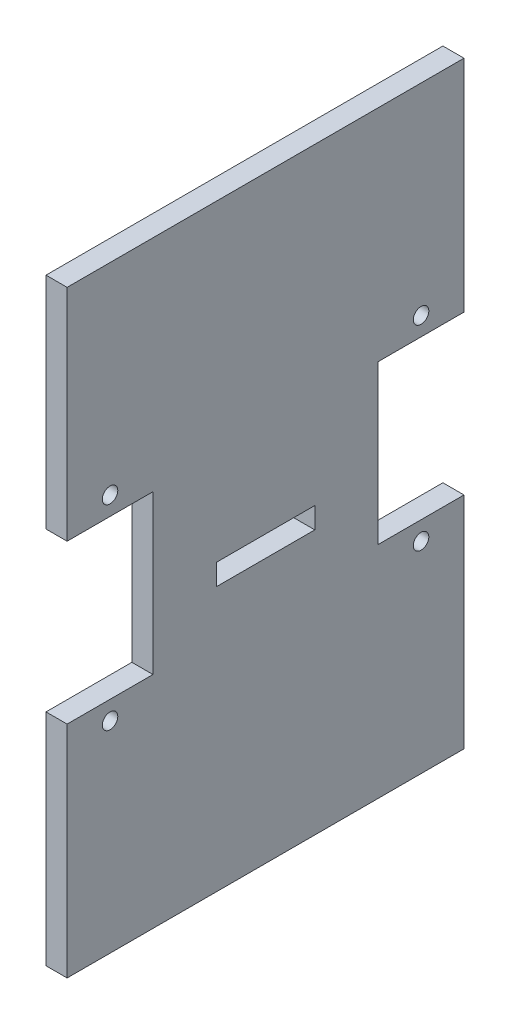
ISO-10303-21;
HEADER;
FILE_DESCRIPTION(('STEP AP214'),'2;1');
FILE_NAME('part.step','',(''),(''),'','','');
FILE_SCHEMA(('AUTOMOTIVE_DESIGN { 1 0 10303 214 1 1 1 1 }'));
ENDSEC;
DATA;
#1=APPLICATION_CONTEXT('core data for automotive mechanical design processes');
#2=APPLICATION_PROTOCOL_DEFINITION('international standard','automotive_design',2000,#1);
#3=PRODUCT_CONTEXT('',#1,'mechanical');
#4=PRODUCT('Part','Part','',(#3));
#5=PRODUCT_RELATED_PRODUCT_CATEGORY('part','',(#4));
#6=PRODUCT_DEFINITION_FORMATION('','',#4);
#7=PRODUCT_DEFINITION_CONTEXT('part definition',#1,'design');
#8=PRODUCT_DEFINITION('design','',#6,#7);
#9=PRODUCT_DEFINITION_SHAPE('','',#8);
#10=(LENGTH_UNIT() NAMED_UNIT(*) SI_UNIT(.MILLI.,.METRE.));
#11=(NAMED_UNIT(*) PLANE_ANGLE_UNIT() SI_UNIT($,.RADIAN.));
#12=(NAMED_UNIT(*) SI_UNIT($,.STERADIAN.) SOLID_ANGLE_UNIT());
#13=UNCERTAINTY_MEASURE_WITH_UNIT(LENGTH_MEASURE(1.E-05),#10,'distance_accuracy_value','');
#14=(GEOMETRIC_REPRESENTATION_CONTEXT(3) GLOBAL_UNCERTAINTY_ASSIGNED_CONTEXT((#13)) GLOBAL_UNIT_ASSIGNED_CONTEXT((#10,
#11,#12)) REPRESENTATION_CONTEXT('',''));
#15=CARTESIAN_POINT('',(0.,0.,0.));
#16=DIRECTION('',(0.,0.,1.));
#17=DIRECTION('',(1.,0.,0.));
#18=AXIS2_PLACEMENT_3D('',#15,#16,#17);
#19=CARTESIAN_POINT('',(3.,0.,0.));
#20=DIRECTION('',(-1.,0.,0.));
#21=DIRECTION('',(0.,0.,1.));
#22=AXIS2_PLACEMENT_3D('',#19,#20,#21);
#23=PLANE('',#22);
#24=DIRECTION('',(0.,0.,-1.));
#25=VECTOR('',#24,1.);
#26=CARTESIAN_POINT('',(3.,-4.95000000000001,7.));
#27=LINE('',#26,#25);
#28=CARTESIAN_POINT('',(3.,-4.95000000000001,7.));
#29=VERTEX_POINT('',#28);
#30=CARTESIAN_POINT('',(3.,-4.95,-7.));
#31=VERTEX_POINT('',#30);
#32=EDGE_CURVE('E172',#29,#31,#27,.T.);
#33=ORIENTED_EDGE('',*,*,#32,.F.);
#34=DIRECTION('',(0.,-1.,0.));
#35=VECTOR('',#34,1.);
#36=CARTESIAN_POINT('',(3.,-1.95000000000001,7.));
#37=LINE('',#36,#35);
#38=CARTESIAN_POINT('',(3.,-1.95000000000001,7.));
#39=VERTEX_POINT('',#38);
#40=EDGE_CURVE('E47',#39,#29,#37,.T.);
#41=ORIENTED_EDGE('',*,*,#40,.F.);
#42=DIRECTION('',(0.,0.,1.));
#43=VECTOR('',#42,1.);
#44=CARTESIAN_POINT('',(3.,-1.95000000000001,7.));
#45=LINE('',#44,#43);
#46=CARTESIAN_POINT('',(3.,-1.95,-7.));
#47=VERTEX_POINT('',#46);
#48=EDGE_CURVE('E163',#47,#39,#45,.T.);
#49=ORIENTED_EDGE('',*,*,#48,.F.);
#50=DIRECTION('',(0.,1.,0.));
#51=VECTOR('',#50,1.);
#52=CARTESIAN_POINT('',(3.,-1.95,-7.));
#53=LINE('',#52,#51);
#54=EDGE_CURVE('E166',#31,#47,#53,.T.);
#55=ORIENTED_EDGE('',*,*,#54,.F.);
#56=EDGE_LOOP('',(#33,#41,#49,#55));
#57=FACE_BOUND('',#56,.T.);
#58=DIRECTION('',(0.,1.,0.));
#59=VECTOR('',#58,1.);
#60=CARTESIAN_POINT('',(3.,11.25,-28.2));
#61=LINE('',#60,#59);
#62=CARTESIAN_POINT('',(3.,11.25,-28.2));
#63=VERTEX_POINT('',#62);
#64=CARTESIAN_POINT('',(3.,42.5,-28.2));
#65=VERTEX_POINT('',#64);
#66=EDGE_CURVE('E206',#63,#65,#61,.T.);
#67=ORIENTED_EDGE('',*,*,#66,.T.);
#68=DIRECTION('',(0.,0.,1.));
#69=VECTOR('',#68,1.);
#70=CARTESIAN_POINT('',(3.,42.5,28.2));
#71=LINE('',#70,#69);
#72=CARTESIAN_POINT('',(3.,42.5,28.2));
#73=VERTEX_POINT('',#72);
#74=EDGE_CURVE('E209',#65,#73,#71,.T.);
#75=ORIENTED_EDGE('',*,*,#74,.T.);
#76=DIRECTION('',(0.,-1.,0.));
#77=VECTOR('',#76,1.);
#78=CARTESIAN_POINT('',(3.,11.25,28.2));
#79=LINE('',#78,#77);
#80=CARTESIAN_POINT('',(3.,11.25,28.2));
#81=VERTEX_POINT('',#80);
#82=EDGE_CURVE('E212',#73,#81,#79,.T.);
#83=ORIENTED_EDGE('',*,*,#82,.T.);
#84=DIRECTION('',(0.,0.,-1.));
#85=VECTOR('',#84,1.);
#86=CARTESIAN_POINT('',(3.,11.25,28.2));
#87=LINE('',#86,#85);
#88=CARTESIAN_POINT('',(3.,11.25,16.));
#89=VERTEX_POINT('',#88);
#90=EDGE_CURVE('E214',#81,#89,#87,.T.);
#91=ORIENTED_EDGE('',*,*,#90,.T.);
#92=DIRECTION('',(0.,-1.,0.));
#93=VECTOR('',#92,1.);
#94=CARTESIAN_POINT('',(3.,-11.25,16.));
#95=LINE('',#94,#93);
#96=CARTESIAN_POINT('',(3.,-11.25,16.));
#97=VERTEX_POINT('',#96);
#98=EDGE_CURVE('E216',#89,#97,#95,.T.);
#99=ORIENTED_EDGE('',*,*,#98,.T.);
#100=DIRECTION('',(0.,0.,1.));
#101=VECTOR('',#100,1.);
#102=CARTESIAN_POINT('',(3.,-11.25,28.2));
#103=LINE('',#102,#101);
#104=CARTESIAN_POINT('',(3.,-11.25,28.2));
#105=VERTEX_POINT('',#104);
#106=EDGE_CURVE('E218',#97,#105,#103,.T.);
#107=ORIENTED_EDGE('',*,*,#106,.T.);
#108=DIRECTION('',(0.,-1.,0.));
#109=VECTOR('',#108,1.);
#110=CARTESIAN_POINT('',(3.,-42.5,28.2));
#111=LINE('',#110,#109);
#112=CARTESIAN_POINT('',(3.,-42.5,28.2));
#113=VERTEX_POINT('',#112);
#114=EDGE_CURVE('E220',#105,#113,#111,.T.);
#115=ORIENTED_EDGE('',*,*,#114,.T.);
#116=DIRECTION('',(0.,0.,-1.));
#117=VECTOR('',#116,1.);
#118=CARTESIAN_POINT('',(3.,-42.5,28.2));
#119=LINE('',#118,#117);
#120=CARTESIAN_POINT('',(3.,-42.5,-28.2));
#121=VERTEX_POINT('',#120);
#122=EDGE_CURVE('E222',#113,#121,#119,.T.);
#123=ORIENTED_EDGE('',*,*,#122,.T.);
#124=DIRECTION('',(0.,1.,0.));
#125=VECTOR('',#124,1.);
#126=CARTESIAN_POINT('',(3.,-42.5,-28.2));
#127=LINE('',#126,#125);
#128=CARTESIAN_POINT('',(3.,-11.25,-28.2));
#129=VERTEX_POINT('',#128);
#130=EDGE_CURVE('E224',#121,#129,#127,.T.);
#131=ORIENTED_EDGE('',*,*,#130,.T.);
#132=DIRECTION('',(0.,0.,1.));
#133=VECTOR('',#132,1.);
#134=CARTESIAN_POINT('',(3.,-11.25,-28.2));
#135=LINE('',#134,#133);
#136=CARTESIAN_POINT('',(3.,-11.25,-16.));
#137=VERTEX_POINT('',#136);
#138=EDGE_CURVE('E226',#129,#137,#135,.T.);
#139=ORIENTED_EDGE('',*,*,#138,.T.);
#140=DIRECTION('',(0.,1.,0.));
#141=VECTOR('',#140,1.);
#142=CARTESIAN_POINT('',(3.,-11.25,-16.));
#143=LINE('',#142,#141);
#144=CARTESIAN_POINT('',(3.,11.25,-16.));
#145=VERTEX_POINT('',#144);
#146=EDGE_CURVE('E228',#137,#145,#143,.T.);
#147=ORIENTED_EDGE('',*,*,#146,.T.);
#148=DIRECTION('',(0.,0.,-1.));
#149=VECTOR('',#148,1.);
#150=CARTESIAN_POINT('',(3.,11.25,-28.2));
#151=LINE('',#150,#149);
#152=EDGE_CURVE('E230',#145,#63,#151,.T.);
#153=ORIENTED_EDGE('',*,*,#152,.T.);
#154=EDGE_LOOP('',(#67,#75,#83,#91,#99,#107,#115,#123,#131,#139,#147,#153));
#155=FACE_BOUND('',#154,.T.);
#156=CARTESIAN_POINT('',(3.,13.9,-22.1));
#157=DIRECTION('',(1.,0.,0.));
#158=DIRECTION('',(0.,0.,-1.));
#159=AXIS2_PLACEMENT_3D('',#156,#157,#158);
#160=CIRCLE('',#159,1.1);
#161=CARTESIAN_POINT('',(3.,13.9,-23.2));
#162=VERTEX_POINT('',#161);
#163=EDGE_CURVE('E200',#162,#162,#160,.T.);
#164=ORIENTED_EDGE('',*,*,#163,.F.);
#165=EDGE_LOOP('',(#164));
#166=FACE_BOUND('',#165,.T.);
#167=CARTESIAN_POINT('',(3.,-13.9,-22.1));
#168=DIRECTION('',(1.,0.,0.));
#169=DIRECTION('',(0.,0.,1.));
#170=AXIS2_PLACEMENT_3D('',#167,#168,#169);
#171=CIRCLE('',#170,1.1);
#172=CARTESIAN_POINT('',(3.,-13.9,-21.));
#173=VERTEX_POINT('',#172);
#174=EDGE_CURVE('E194',#173,#173,#171,.T.);
#175=ORIENTED_EDGE('',*,*,#174,.F.);
#176=EDGE_LOOP('',(#175));
#177=FACE_BOUND('',#176,.T.);
#178=CARTESIAN_POINT('',(3.,-13.9,22.1));
#179=DIRECTION('',(1.,0.,0.));
#180=DIRECTION('',(0.,0.,-1.));
#181=AXIS2_PLACEMENT_3D('',#178,#179,#180);
#182=CIRCLE('',#181,1.1);
#183=CARTESIAN_POINT('',(3.,-13.9,21.));
#184=VERTEX_POINT('',#183);
#185=EDGE_CURVE('E188',#184,#184,#182,.T.);
#186=ORIENTED_EDGE('',*,*,#185,.F.);
#187=EDGE_LOOP('',(#186));
#188=FACE_BOUND('',#187,.T.);
#189=CARTESIAN_POINT('',(3.,13.9,22.1));
#190=DIRECTION('',(1.,0.,0.));
#191=DIRECTION('',(0.,0.,1.));
#192=AXIS2_PLACEMENT_3D('',#189,#190,#191);
#193=CIRCLE('',#192,1.1);
#194=CARTESIAN_POINT('',(3.,13.9,23.2));
#195=VERTEX_POINT('',#194);
#196=EDGE_CURVE('E182',#195,#195,#193,.T.);
#197=ORIENTED_EDGE('',*,*,#196,.F.);
#198=EDGE_LOOP('',(#197));
#199=FACE_BOUND('',#198,.T.);
#200=ADVANCED_FACE('F32',(#57,#155,#166,#177,#188,#199),#23,.F.);
#201=CARTESIAN_POINT('',(0.,0.,0.));
#202=DIRECTION('',(-1.,0.,0.));
#203=DIRECTION('',(0.,0.,1.));
#204=AXIS2_PLACEMENT_3D('',#201,#202,#203);
#205=PLANE('',#204);
#206=DIRECTION('',(0.,-1.,0.));
#207=VECTOR('',#206,1.);
#208=CARTESIAN_POINT('',(0.,-1.95000000000001,7.));
#209=LINE('',#208,#207);
#210=CARTESIAN_POINT('',(0.,-1.95000000000001,7.));
#211=VERTEX_POINT('',#210);
#212=CARTESIAN_POINT('',(0.,-4.95000000000001,7.));
#213=VERTEX_POINT('',#212);
#214=EDGE_CURVE('E147',#211,#213,#209,.T.);
#215=ORIENTED_EDGE('',*,*,#214,.T.);
#216=DIRECTION('',(0.,0.,-1.));
#217=VECTOR('',#216,1.);
#218=CARTESIAN_POINT('',(0.,-4.95000000000001,7.));
#219=LINE('',#218,#217);
#220=CARTESIAN_POINT('',(0.,-4.95,-7.));
#221=VERTEX_POINT('',#220);
#222=EDGE_CURVE('E156',#213,#221,#219,.T.);
#223=ORIENTED_EDGE('',*,*,#222,.T.);
#224=DIRECTION('',(0.,1.,0.));
#225=VECTOR('',#224,1.);
#226=CARTESIAN_POINT('',(0.,-1.95,-7.));
#227=LINE('',#226,#225);
#228=CARTESIAN_POINT('',(0.,-1.95,-7.));
#229=VERTEX_POINT('',#228);
#230=EDGE_CURVE('E55',#221,#229,#227,.T.);
#231=ORIENTED_EDGE('',*,*,#230,.T.);
#232=DIRECTION('',(0.,0.,1.));
#233=VECTOR('',#232,1.);
#234=CARTESIAN_POINT('',(0.,-1.95000000000001,7.));
#235=LINE('',#234,#233);
#236=EDGE_CURVE('E153',#229,#211,#235,.T.);
#237=ORIENTED_EDGE('',*,*,#236,.T.);
#238=EDGE_LOOP('',(#215,#223,#231,#237));
#239=FACE_BOUND('',#238,.T.);
#240=CARTESIAN_POINT('',(0.,-13.9,22.1));
#241=DIRECTION('',(1.,0.,0.));
#242=DIRECTION('',(0.,0.,-1.));
#243=AXIS2_PLACEMENT_3D('',#240,#241,#242);
#244=CIRCLE('',#243,1.1);
#245=CARTESIAN_POINT('',(0.,-13.9,21.));
#246=VERTEX_POINT('',#245);
#247=EDGE_CURVE('E185',#246,#246,#244,.T.);
#248=ORIENTED_EDGE('',*,*,#247,.T.);
#249=EDGE_LOOP('',(#248));
#250=FACE_BOUND('',#249,.T.);
#251=CARTESIAN_POINT('',(0.,13.9,-22.1));
#252=DIRECTION('',(1.,0.,0.));
#253=DIRECTION('',(0.,0.,-1.));
#254=AXIS2_PLACEMENT_3D('',#251,#252,#253);
#255=CIRCLE('',#254,1.1);
#256=CARTESIAN_POINT('',(0.,13.9,-23.2));
#257=VERTEX_POINT('',#256);
#258=EDGE_CURVE('E197',#257,#257,#255,.T.);
#259=ORIENTED_EDGE('',*,*,#258,.T.);
#260=EDGE_LOOP('',(#259));
#261=FACE_BOUND('',#260,.T.);
#262=DIRECTION('',(0.,1.,0.));
#263=VECTOR('',#262,1.);
#264=CARTESIAN_POINT('',(0.,11.25,-28.2));
#265=LINE('',#264,#263);
#266=CARTESIAN_POINT('',(0.,11.25,-28.2));
#267=VERTEX_POINT('',#266);
#268=CARTESIAN_POINT('',(0.,42.5,-28.2));
#269=VERTEX_POINT('',#268);
#270=EDGE_CURVE('E203',#267,#269,#265,.T.);
#271=ORIENTED_EDGE('',*,*,#270,.F.);
#272=DIRECTION('',(0.,0.,-1.));
#273=VECTOR('',#272,1.);
#274=CARTESIAN_POINT('',(0.,11.25,-28.2));
#275=LINE('',#274,#273);
#276=CARTESIAN_POINT('',(0.,11.25,-16.));
#277=VERTEX_POINT('',#276);
#278=EDGE_CURVE('E210',#277,#267,#275,.T.);
#279=ORIENTED_EDGE('',*,*,#278,.F.);
#280=DIRECTION('',(0.,1.,0.));
#281=VECTOR('',#280,1.);
#282=CARTESIAN_POINT('',(0.,-11.25,-16.));
#283=LINE('',#282,#281);
#284=CARTESIAN_POINT('',(0.,-11.25,-16.));
#285=VERTEX_POINT('',#284);
#286=EDGE_CURVE('E253',#285,#277,#283,.T.);
#287=ORIENTED_EDGE('',*,*,#286,.F.);
#288=DIRECTION('',(0.,0.,1.));
#289=VECTOR('',#288,1.);
#290=CARTESIAN_POINT('',(0.,-11.25,-28.2));
#291=LINE('',#290,#289);
#292=CARTESIAN_POINT('',(0.,-11.25,-28.2));
#293=VERTEX_POINT('',#292);
#294=EDGE_CURVE('E251',#293,#285,#291,.T.);
#295=ORIENTED_EDGE('',*,*,#294,.F.);
#296=DIRECTION('',(0.,1.,0.));
#297=VECTOR('',#296,1.);
#298=CARTESIAN_POINT('',(0.,-42.5,-28.2));
#299=LINE('',#298,#297);
#300=CARTESIAN_POINT('',(0.,-42.5,-28.2));
#301=VERTEX_POINT('',#300);
#302=EDGE_CURVE('E249',#301,#293,#299,.T.);
#303=ORIENTED_EDGE('',*,*,#302,.F.);
#304=DIRECTION('',(0.,0.,-1.));
#305=VECTOR('',#304,1.);
#306=CARTESIAN_POINT('',(0.,-42.5,28.2));
#307=LINE('',#306,#305);
#308=CARTESIAN_POINT('',(0.,-42.5,28.2));
#309=VERTEX_POINT('',#308);
#310=EDGE_CURVE('E247',#309,#301,#307,.T.);
#311=ORIENTED_EDGE('',*,*,#310,.F.);
#312=DIRECTION('',(0.,-1.,0.));
#313=VECTOR('',#312,1.);
#314=CARTESIAN_POINT('',(0.,-42.5,28.2));
#315=LINE('',#314,#313);
#316=CARTESIAN_POINT('',(0.,-11.25,28.2));
#317=VERTEX_POINT('',#316);
#318=EDGE_CURVE('E245',#317,#309,#315,.T.);
#319=ORIENTED_EDGE('',*,*,#318,.F.);
#320=DIRECTION('',(0.,0.,1.));
#321=VECTOR('',#320,1.);
#322=CARTESIAN_POINT('',(0.,-11.25,28.2));
#323=LINE('',#322,#321);
#324=CARTESIAN_POINT('',(0.,-11.25,16.));
#325=VERTEX_POINT('',#324);
#326=EDGE_CURVE('E243',#325,#317,#323,.T.);
#327=ORIENTED_EDGE('',*,*,#326,.F.);
#328=DIRECTION('',(0.,-1.,0.));
#329=VECTOR('',#328,1.);
#330=CARTESIAN_POINT('',(0.,-11.25,16.));
#331=LINE('',#330,#329);
#332=CARTESIAN_POINT('',(0.,11.25,16.));
#333=VERTEX_POINT('',#332);
#334=EDGE_CURVE('E241',#333,#325,#331,.T.);
#335=ORIENTED_EDGE('',*,*,#334,.F.);
#336=DIRECTION('',(0.,0.,-1.));
#337=VECTOR('',#336,1.);
#338=CARTESIAN_POINT('',(0.,11.25,28.2));
#339=LINE('',#338,#337);
#340=CARTESIAN_POINT('',(0.,11.25,28.2));
#341=VERTEX_POINT('',#340);
#342=EDGE_CURVE('E239',#341,#333,#339,.T.);
#343=ORIENTED_EDGE('',*,*,#342,.F.);
#344=DIRECTION('',(0.,-1.,0.));
#345=VECTOR('',#344,1.);
#346=CARTESIAN_POINT('',(0.,11.25,28.2));
#347=LINE('',#346,#345);
#348=CARTESIAN_POINT('',(0.,42.5,28.2));
#349=VERTEX_POINT('',#348);
#350=EDGE_CURVE('E237',#349,#341,#347,.T.);
#351=ORIENTED_EDGE('',*,*,#350,.F.);
#352=DIRECTION('',(0.,0.,1.));
#353=VECTOR('',#352,1.);
#354=CARTESIAN_POINT('',(0.,42.5,28.2));
#355=LINE('',#354,#353);
#356=EDGE_CURVE('E235',#269,#349,#355,.T.);
#357=ORIENTED_EDGE('',*,*,#356,.F.);
#358=EDGE_LOOP('',(#271,#279,#287,#295,#303,#311,#319,#327,#335,#343,#351,#357));
#359=FACE_BOUND('',#358,.T.);
#360=CARTESIAN_POINT('',(0.,-13.9,-22.1));
#361=DIRECTION('',(1.,0.,0.));
#362=DIRECTION('',(0.,0.,1.));
#363=AXIS2_PLACEMENT_3D('',#360,#361,#362);
#364=CIRCLE('',#363,1.1);
#365=CARTESIAN_POINT('',(0.,-13.9,-21.));
#366=VERTEX_POINT('',#365);
#367=EDGE_CURVE('E191',#366,#366,#364,.T.);
#368=ORIENTED_EDGE('',*,*,#367,.T.);
#369=EDGE_LOOP('',(#368));
#370=FACE_BOUND('',#369,.T.);
#371=CARTESIAN_POINT('',(0.,13.9,22.1));
#372=DIRECTION('',(1.,0.,0.));
#373=DIRECTION('',(0.,0.,1.));
#374=AXIS2_PLACEMENT_3D('',#371,#372,#373);
#375=CIRCLE('',#374,1.1);
#376=CARTESIAN_POINT('',(0.,13.9,23.2));
#377=VERTEX_POINT('',#376);
#378=EDGE_CURVE('E178',#377,#377,#375,.T.);
#379=ORIENTED_EDGE('',*,*,#378,.T.);
#380=EDGE_LOOP('',(#379));
#381=FACE_BOUND('',#380,.T.);
#382=ADVANCED_FACE('F160',(#239,#250,#261,#359,#370,#381),#205,.T.);
#383=CARTESIAN_POINT('',(3.,11.25,-28.2));
#384=DIRECTION('',(0.,0.,1.));
#385=DIRECTION('',(0.,-1.,0.));
#386=AXIS2_PLACEMENT_3D('',#383,#384,#385);
#387=PLANE('',#386);
#388=ORIENTED_EDGE('',*,*,#270,.T.);
#389=DIRECTION('',(-1.,0.,0.));
#390=VECTOR('',#389,1.);
#391=CARTESIAN_POINT('',(3.,42.5,-28.2));
#392=LINE('',#391,#390);
#393=EDGE_CURVE('E11',#65,#269,#392,.T.);
#394=ORIENTED_EDGE('',*,*,#393,.F.);
#395=ORIENTED_EDGE('',*,*,#66,.F.);
#396=DIRECTION('',(-1.,0.,0.));
#397=VECTOR('',#396,1.);
#398=CARTESIAN_POINT('',(3.,11.25,-28.2));
#399=LINE('',#398,#397);
#400=EDGE_CURVE('E232',#63,#267,#399,.T.);
#401=ORIENTED_EDGE('',*,*,#400,.T.);
#402=EDGE_LOOP('',(#388,#394,#395,#401));
#403=FACE_BOUND('',#402,.T.);
#404=ADVANCED_FACE('F34',(#403),#387,.F.);
#405=CARTESIAN_POINT('',(3.,42.5,28.2));
#406=DIRECTION('',(0.,-1.,0.));
#407=DIRECTION('',(0.,0.,-1.));
#408=AXIS2_PLACEMENT_3D('',#405,#406,#407);
#409=PLANE('',#408);
#410=ORIENTED_EDGE('',*,*,#356,.T.);
#411=DIRECTION('',(-1.,0.,0.));
#412=VECTOR('',#411,1.);
#413=CARTESIAN_POINT('',(3.,42.5,28.2));
#414=LINE('',#413,#412);
#415=EDGE_CURVE('E40',#73,#349,#414,.T.);
#416=ORIENTED_EDGE('',*,*,#415,.F.);
#417=ORIENTED_EDGE('',*,*,#74,.F.);
#418=ORIENTED_EDGE('',*,*,#393,.T.);
#419=EDGE_LOOP('',(#410,#416,#417,#418));
#420=FACE_BOUND('',#419,.T.);
#421=ADVANCED_FACE('F312',(#420),#409,.F.);
#422=CARTESIAN_POINT('',(3.,11.25,28.2));
#423=DIRECTION('',(0.,0.,-1.));
#424=DIRECTION('',(0.,1.,0.));
#425=AXIS2_PLACEMENT_3D('',#422,#423,#424);
#426=PLANE('',#425);
#427=ORIENTED_EDGE('',*,*,#350,.T.);
#428=DIRECTION('',(-1.,0.,0.));
#429=VECTOR('',#428,1.);
#430=CARTESIAN_POINT('',(3.,11.25,28.2));
#431=LINE('',#430,#429);
#432=EDGE_CURVE('E282',#81,#341,#431,.T.);
#433=ORIENTED_EDGE('',*,*,#432,.F.);
#434=ORIENTED_EDGE('',*,*,#82,.F.);
#435=ORIENTED_EDGE('',*,*,#415,.T.);
#436=EDGE_LOOP('',(#427,#433,#434,#435));
#437=FACE_BOUND('',#436,.T.);
#438=ADVANCED_FACE('F289',(#437),#426,.F.);
#439=CARTESIAN_POINT('',(3.,11.25,28.2));
#440=DIRECTION('',(0.,1.,0.));
#441=DIRECTION('',(0.,0.,1.));
#442=AXIS2_PLACEMENT_3D('',#439,#440,#441);
#443=PLANE('',#442);
#444=ORIENTED_EDGE('',*,*,#342,.T.);
#445=DIRECTION('',(-1.,0.,0.));
#446=VECTOR('',#445,1.);
#447=CARTESIAN_POINT('',(3.,11.25,16.));
#448=LINE('',#447,#446);
#449=EDGE_CURVE('E279',#89,#333,#448,.T.);
#450=ORIENTED_EDGE('',*,*,#449,.F.);
#451=ORIENTED_EDGE('',*,*,#90,.F.);
#452=ORIENTED_EDGE('',*,*,#432,.T.);
#453=EDGE_LOOP('',(#444,#450,#451,#452));
#454=FACE_BOUND('',#453,.T.);
#455=ADVANCED_FACE('F300',(#454),#443,.F.);
#456=CARTESIAN_POINT('',(3.,-11.25,16.));
#457=DIRECTION('',(0.,0.,-1.));
#458=DIRECTION('',(-1.,0.,0.));
#459=AXIS2_PLACEMENT_3D('',#456,#457,#458);
#460=PLANE('',#459);
#461=ORIENTED_EDGE('',*,*,#334,.T.);
#462=DIRECTION('',(-1.,0.,0.));
#463=VECTOR('',#462,1.);
#464=CARTESIAN_POINT('',(3.,-11.25,16.));
#465=LINE('',#464,#463);
#466=EDGE_CURVE('E276',#97,#325,#465,.T.);
#467=ORIENTED_EDGE('',*,*,#466,.F.);
#468=ORIENTED_EDGE('',*,*,#98,.F.);
#469=ORIENTED_EDGE('',*,*,#449,.T.);
#470=EDGE_LOOP('',(#461,#467,#468,#469));
#471=FACE_BOUND('',#470,.T.);
#472=ADVANCED_FACE('F304',(#471),#460,.F.);
#473=CARTESIAN_POINT('',(3.,-11.25,28.2));
#474=DIRECTION('',(0.,-1.,0.));
#475=DIRECTION('',(0.,0.,-1.));
#476=AXIS2_PLACEMENT_3D('',#473,#474,#475);
#477=PLANE('',#476);
#478=ORIENTED_EDGE('',*,*,#326,.T.);
#479=DIRECTION('',(-1.,0.,0.));
#480=VECTOR('',#479,1.);
#481=CARTESIAN_POINT('',(3.,-11.25,28.2));
#482=LINE('',#481,#480);
#483=EDGE_CURVE('E273',#105,#317,#482,.T.);
#484=ORIENTED_EDGE('',*,*,#483,.F.);
#485=ORIENTED_EDGE('',*,*,#106,.F.);
#486=ORIENTED_EDGE('',*,*,#466,.T.);
#487=EDGE_LOOP('',(#478,#484,#485,#486));
#488=FACE_BOUND('',#487,.T.);
#489=ADVANCED_FACE('F345',(#488),#477,.F.);
#490=CARTESIAN_POINT('',(3.,-42.5,28.2));
#491=DIRECTION('',(0.,0.,-1.));
#492=DIRECTION('',(-1.,0.,0.));
#493=AXIS2_PLACEMENT_3D('',#490,#491,#492);
#494=PLANE('',#493);
#495=ORIENTED_EDGE('',*,*,#318,.T.);
#496=DIRECTION('',(-1.,0.,0.));
#497=VECTOR('',#496,1.);
#498=CARTESIAN_POINT('',(3.,-42.5,28.2));
#499=LINE('',#498,#497);
#500=EDGE_CURVE('E270',#113,#309,#499,.T.);
#501=ORIENTED_EDGE('',*,*,#500,.F.);
#502=ORIENTED_EDGE('',*,*,#114,.F.);
#503=ORIENTED_EDGE('',*,*,#483,.T.);
#504=EDGE_LOOP('',(#495,#501,#502,#503));
#505=FACE_BOUND('',#504,.T.);
#506=ADVANCED_FACE('F343',(#505),#494,.F.);
#507=CARTESIAN_POINT('',(3.,-42.5,28.2));
#508=DIRECTION('',(0.,1.,0.));
#509=DIRECTION('',(0.,0.,1.));
#510=AXIS2_PLACEMENT_3D('',#507,#508,#509);
#511=PLANE('',#510);
#512=ORIENTED_EDGE('',*,*,#310,.T.);
#513=DIRECTION('',(-1.,0.,0.));
#514=VECTOR('',#513,1.);
#515=CARTESIAN_POINT('',(3.,-42.5,-28.2));
#516=LINE('',#515,#514);
#517=EDGE_CURVE('E267',#121,#301,#516,.T.);
#518=ORIENTED_EDGE('',*,*,#517,.F.);
#519=ORIENTED_EDGE('',*,*,#122,.F.);
#520=ORIENTED_EDGE('',*,*,#500,.T.);
#521=EDGE_LOOP('',(#512,#518,#519,#520));
#522=FACE_BOUND('',#521,.T.);
#523=ADVANCED_FACE('F339',(#522),#511,.F.);
#524=CARTESIAN_POINT('',(3.,-42.5,-28.2));
#525=DIRECTION('',(0.,0.,1.));
#526=DIRECTION('',(0.,-1.,0.));
#527=AXIS2_PLACEMENT_3D('',#524,#525,#526);
#528=PLANE('',#527);
#529=ORIENTED_EDGE('',*,*,#302,.T.);
#530=DIRECTION('',(-1.,0.,0.));
#531=VECTOR('',#530,1.);
#532=CARTESIAN_POINT('',(3.,-11.25,-28.2));
#533=LINE('',#532,#531);
#534=EDGE_CURVE('E264',#129,#293,#533,.T.);
#535=ORIENTED_EDGE('',*,*,#534,.F.);
#536=ORIENTED_EDGE('',*,*,#130,.F.);
#537=ORIENTED_EDGE('',*,*,#517,.T.);
#538=EDGE_LOOP('',(#529,#535,#536,#537));
#539=FACE_BOUND('',#538,.T.);
#540=ADVANCED_FACE('F334',(#539),#528,.F.);
#541=CARTESIAN_POINT('',(3.,-11.25,-28.2));
#542=DIRECTION('',(0.,-1.,0.));
#543=DIRECTION('',(0.,0.,-1.));
#544=AXIS2_PLACEMENT_3D('',#541,#542,#543);
#545=PLANE('',#544);
#546=ORIENTED_EDGE('',*,*,#294,.T.);
#547=DIRECTION('',(-1.,0.,0.));
#548=VECTOR('',#547,1.);
#549=CARTESIAN_POINT('',(3.,-11.25,-16.));
#550=LINE('',#549,#548);
#551=EDGE_CURVE('E261',#137,#285,#550,.T.);
#552=ORIENTED_EDGE('',*,*,#551,.F.);
#553=ORIENTED_EDGE('',*,*,#138,.F.);
#554=ORIENTED_EDGE('',*,*,#534,.T.);
#555=EDGE_LOOP('',(#546,#552,#553,#554));
#556=FACE_BOUND('',#555,.T.);
#557=ADVANCED_FACE('F328',(#556),#545,.F.);
#558=CARTESIAN_POINT('',(3.,-11.25,-16.));
#559=DIRECTION('',(0.,0.,1.));
#560=DIRECTION('',(1.,0.,0.));
#561=AXIS2_PLACEMENT_3D('',#558,#559,#560);
#562=PLANE('',#561);
#563=ORIENTED_EDGE('',*,*,#286,.T.);
#564=DIRECTION('',(-1.,0.,0.));
#565=VECTOR('',#564,1.);
#566=CARTESIAN_POINT('',(3.,11.25,-16.));
#567=LINE('',#566,#565);
#568=EDGE_CURVE('E258',#145,#277,#567,.T.);
#569=ORIENTED_EDGE('',*,*,#568,.F.);
#570=ORIENTED_EDGE('',*,*,#146,.F.);
#571=ORIENTED_EDGE('',*,*,#551,.T.);
#572=EDGE_LOOP('',(#563,#569,#570,#571));
#573=FACE_BOUND('',#572,.T.);
#574=ADVANCED_FACE('F324',(#573),#562,.F.);
#575=CARTESIAN_POINT('',(3.,11.25,-28.2));
#576=DIRECTION('',(0.,1.,0.));
#577=DIRECTION('',(0.,0.,1.));
#578=AXIS2_PLACEMENT_3D('',#575,#576,#577);
#579=PLANE('',#578);
#580=ORIENTED_EDGE('',*,*,#278,.T.);
#581=ORIENTED_EDGE('',*,*,#400,.F.);
#582=ORIENTED_EDGE('',*,*,#152,.F.);
#583=ORIENTED_EDGE('',*,*,#568,.T.);
#584=EDGE_LOOP('',(#580,#581,#582,#583));
#585=FACE_BOUND('',#584,.T.);
#586=ADVANCED_FACE('F319',(#585),#579,.F.);
#587=CARTESIAN_POINT('',(3.,13.9,-22.1));
#588=DIRECTION('',(-1.,0.,0.));
#589=DIRECTION('',(0.,0.,1.));
#590=AXIS2_PLACEMENT_3D('',#587,#588,#589);
#591=CYLINDRICAL_SURFACE('',#590,1.1);
#592=ORIENTED_EDGE('',*,*,#163,.T.);
#593=EDGE_LOOP('',(#592));
#594=FACE_BOUND('',#593,.T.);
#595=ORIENTED_EDGE('',*,*,#258,.F.);
#596=EDGE_LOOP('',(#595));
#597=FACE_BOUND('',#596,.T.);
#598=ADVANCED_FACE('F362',(#594,#597),#591,.F.);
#599=CARTESIAN_POINT('',(3.,-13.9,-22.1));
#600=DIRECTION('',(-1.,0.,0.));
#601=DIRECTION('',(0.,0.,1.));
#602=AXIS2_PLACEMENT_3D('',#599,#600,#601);
#603=CYLINDRICAL_SURFACE('',#602,1.1);
#604=ORIENTED_EDGE('',*,*,#174,.T.);
#605=EDGE_LOOP('',(#604));
#606=FACE_BOUND('',#605,.T.);
#607=ORIENTED_EDGE('',*,*,#367,.F.);
#608=EDGE_LOOP('',(#607));
#609=FACE_BOUND('',#608,.T.);
#610=ADVANCED_FACE('F400',(#606,#609),#603,.F.);
#611=CARTESIAN_POINT('',(3.,-13.9,22.1));
#612=DIRECTION('',(-1.,0.,0.));
#613=DIRECTION('',(0.,0.,1.));
#614=AXIS2_PLACEMENT_3D('',#611,#612,#613);
#615=CYLINDRICAL_SURFACE('',#614,1.1);
#616=ORIENTED_EDGE('',*,*,#185,.T.);
#617=EDGE_LOOP('',(#616));
#618=FACE_BOUND('',#617,.T.);
#619=ORIENTED_EDGE('',*,*,#247,.F.);
#620=EDGE_LOOP('',(#619));
#621=FACE_BOUND('',#620,.T.);
#622=ADVANCED_FACE('F407',(#618,#621),#615,.F.);
#623=CARTESIAN_POINT('',(3.,13.9,22.1));
#624=DIRECTION('',(-1.,0.,0.));
#625=DIRECTION('',(0.,0.,1.));
#626=AXIS2_PLACEMENT_3D('',#623,#624,#625);
#627=CYLINDRICAL_SURFACE('',#626,1.1);
#628=ORIENTED_EDGE('',*,*,#196,.T.);
#629=EDGE_LOOP('',(#628));
#630=FACE_BOUND('',#629,.T.);
#631=ORIENTED_EDGE('',*,*,#378,.F.);
#632=EDGE_LOOP('',(#631));
#633=FACE_BOUND('',#632,.T.);
#634=ADVANCED_FACE('F414',(#630,#633),#627,.F.);
#635=CARTESIAN_POINT('',(0.,-1.95000000000001,7.));
#636=DIRECTION('',(0.,0.,1.));
#637=DIRECTION('',(0.,-1.,0.));
#638=AXIS2_PLACEMENT_3D('',#635,#636,#637);
#639=PLANE('',#638);
#640=ORIENTED_EDGE('',*,*,#40,.T.);
#641=DIRECTION('',(1.,0.,0.));
#642=VECTOR('',#641,1.);
#643=CARTESIAN_POINT('',(0.,-4.95000000000001,7.));
#644=LINE('',#643,#642);
#645=EDGE_CURVE('E143',#213,#29,#644,.T.);
#646=ORIENTED_EDGE('',*,*,#645,.F.);
#647=ORIENTED_EDGE('',*,*,#214,.F.);
#648=DIRECTION('',(1.,0.,0.));
#649=VECTOR('',#648,1.);
#650=CARTESIAN_POINT('',(0.,-1.95000000000001,7.));
#651=LINE('',#650,#649);
#652=EDGE_CURVE('E176',#211,#39,#651,.T.);
#653=ORIENTED_EDGE('',*,*,#652,.T.);
#654=EDGE_LOOP('',(#640,#646,#647,#653));
#655=FACE_BOUND('',#654,.T.);
#656=ADVANCED_FACE('F145',(#655),#639,.F.);
#657=CARTESIAN_POINT('',(0.,-1.95000000000001,7.));
#658=DIRECTION('',(0.,1.,0.));
#659=DIRECTION('',(0.,0.,1.));
#660=AXIS2_PLACEMENT_3D('',#657,#658,#659);
#661=PLANE('',#660);
#662=ORIENTED_EDGE('',*,*,#48,.T.);
#663=ORIENTED_EDGE('',*,*,#652,.F.);
#664=ORIENTED_EDGE('',*,*,#236,.F.);
#665=DIRECTION('',(1.,0.,0.));
#666=VECTOR('',#665,1.);
#667=CARTESIAN_POINT('',(0.,-1.95,-7.));
#668=LINE('',#667,#666);
#669=EDGE_CURVE('E179',#229,#47,#668,.T.);
#670=ORIENTED_EDGE('',*,*,#669,.T.);
#671=EDGE_LOOP('',(#662,#663,#664,#670));
#672=FACE_BOUND('',#671,.T.);
#673=ADVANCED_FACE('F429',(#672),#661,.F.);
#674=CARTESIAN_POINT('',(0.,-1.95,-7.));
#675=DIRECTION('',(0.,0.,-1.));
#676=DIRECTION('',(0.,1.,0.));
#677=AXIS2_PLACEMENT_3D('',#674,#675,#676);
#678=PLANE('',#677);
#679=ORIENTED_EDGE('',*,*,#54,.T.);
#680=ORIENTED_EDGE('',*,*,#669,.F.);
#681=ORIENTED_EDGE('',*,*,#230,.F.);
#682=DIRECTION('',(1.,0.,0.));
#683=VECTOR('',#682,1.);
#684=CARTESIAN_POINT('',(0.,-4.95,-7.));
#685=LINE('',#684,#683);
#686=EDGE_CURVE('E152',#221,#31,#685,.T.);
#687=ORIENTED_EDGE('',*,*,#686,.T.);
#688=EDGE_LOOP('',(#679,#680,#681,#687));
#689=FACE_BOUND('',#688,.T.);
#690=ADVANCED_FACE('F437',(#689),#678,.F.);
#691=CARTESIAN_POINT('',(0.,-4.95000000000001,7.));
#692=DIRECTION('',(0.,-1.,0.));
#693=DIRECTION('',(0.,0.,-1.));
#694=AXIS2_PLACEMENT_3D('',#691,#692,#693);
#695=PLANE('',#694);
#696=ORIENTED_EDGE('',*,*,#32,.T.);
#697=ORIENTED_EDGE('',*,*,#686,.F.);
#698=ORIENTED_EDGE('',*,*,#222,.F.);
#699=ORIENTED_EDGE('',*,*,#645,.T.);
#700=EDGE_LOOP('',(#696,#697,#698,#699));
#701=FACE_BOUND('',#700,.T.);
#702=ADVANCED_FACE('F157',(#701),#695,.F.);
#703=CLOSED_SHELL('',(#200,#382,#404,#421,#438,#455,#472,#489,#506,#523,#540,#557,#574,#586,
#598,#610,#622,#634,#656,#673,#690,#702));
#704=MANIFOLD_SOLID_BREP('B2',#703);
#705=ADVANCED_BREP_SHAPE_REPRESENTATION('',(#18,#704),#14);
#706=SHAPE_DEFINITION_REPRESENTATION(#9,#705);
ENDSEC;
END-ISO-10303-21;
